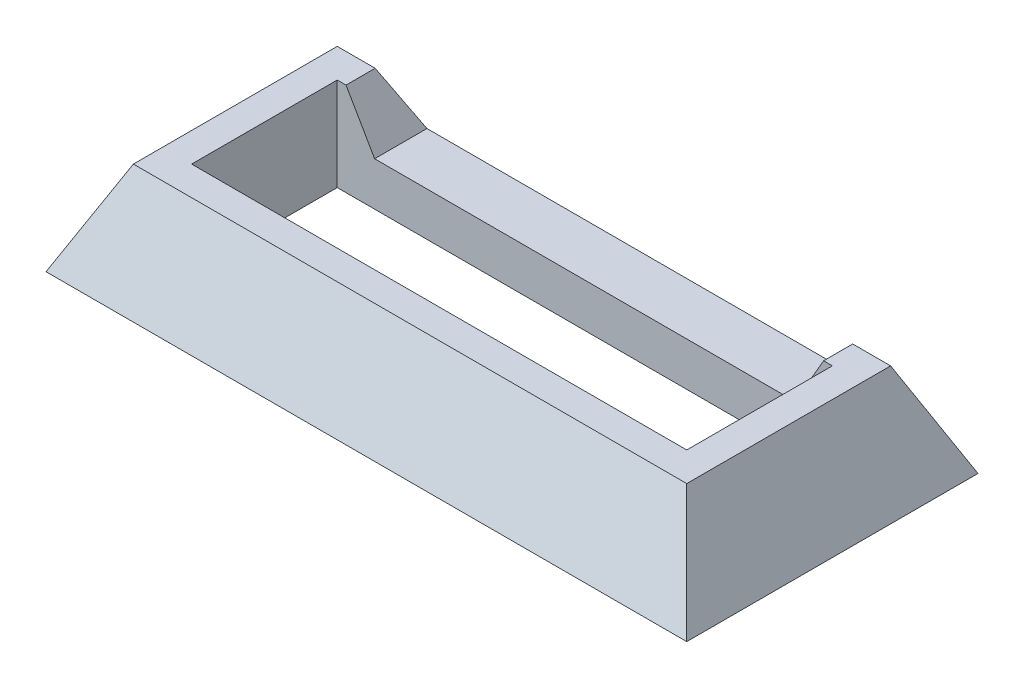
ISO-10303-21;
HEADER;
FILE_DESCRIPTION(('STEP AP214'),'2;1');
FILE_NAME('part.step','',(''),(''),'','','');
FILE_SCHEMA(('AUTOMOTIVE_DESIGN { 1 0 10303 214 1 1 1 1 }'));
ENDSEC;
DATA;
#1=APPLICATION_CONTEXT('core data for automotive mechanical design processes');
#2=APPLICATION_PROTOCOL_DEFINITION('international standard','automotive_design',2000,#1);
#3=PRODUCT_CONTEXT('',#1,'mechanical');
#4=PRODUCT('Part','Part','',(#3));
#5=PRODUCT_RELATED_PRODUCT_CATEGORY('part','',(#4));
#6=PRODUCT_DEFINITION_FORMATION('','',#4);
#7=PRODUCT_DEFINITION_CONTEXT('part definition',#1,'design');
#8=PRODUCT_DEFINITION('design','',#6,#7);
#9=PRODUCT_DEFINITION_SHAPE('','',#8);
#10=(LENGTH_UNIT() NAMED_UNIT(*) SI_UNIT(.MILLI.,.METRE.));
#11=(NAMED_UNIT(*) PLANE_ANGLE_UNIT() SI_UNIT($,.RADIAN.));
#12=(NAMED_UNIT(*) SI_UNIT($,.STERADIAN.) SOLID_ANGLE_UNIT());
#13=UNCERTAINTY_MEASURE_WITH_UNIT(LENGTH_MEASURE(1.E-05),#10,'distance_accuracy_value','');
#14=(GEOMETRIC_REPRESENTATION_CONTEXT(3) GLOBAL_UNCERTAINTY_ASSIGNED_CONTEXT((#13)) GLOBAL_UNIT_ASSIGNED_CONTEXT((#10,
#11,#12)) REPRESENTATION_CONTEXT('',''));
#15=CARTESIAN_POINT('',(0.,0.,0.));
#16=DIRECTION('',(0.,0.,1.));
#17=DIRECTION('',(1.,0.,0.));
#18=AXIS2_PLACEMENT_3D('',#15,#16,#17);
#19=CARTESIAN_POINT('',(0.,0.,0.));
#20=DIRECTION('',(0.,-1.,0.));
#21=DIRECTION('',(0.,0.,-1.));
#22=AXIS2_PLACEMENT_3D('',#19,#20,#21);
#23=PLANE('',#22);
#24=DIRECTION('',(0.,0.,1.));
#25=VECTOR('',#24,1.);
#26=CARTESIAN_POINT('',(8.5,0.,0.));
#27=LINE('',#26,#25);
#28=CARTESIAN_POINT('',(8.5,0.,-2.5));
#29=VERTEX_POINT('',#28);
#30=CARTESIAN_POINT('',(8.5,0.,2.5));
#31=VERTEX_POINT('',#30);
#32=EDGE_CURVE('E69',#29,#31,#27,.T.);
#33=ORIENTED_EDGE('',*,*,#32,.F.);
#34=DIRECTION('',(1.,0.,0.));
#35=VECTOR('',#34,1.);
#36=CARTESIAN_POINT('',(0.,0.,-2.5));
#37=LINE('',#36,#35);
#38=CARTESIAN_POINT('',(-8.5,0.,-2.5));
#39=VERTEX_POINT('',#38);
#40=EDGE_CURVE('E171',#39,#29,#37,.T.);
#41=ORIENTED_EDGE('',*,*,#40,.F.);
#42=DIRECTION('',(0.,0.,1.));
#43=VECTOR('',#42,1.);
#44=CARTESIAN_POINT('',(-8.5,0.,0.));
#45=LINE('',#44,#43);
#46=CARTESIAN_POINT('',(-8.5,0.,2.5));
#47=VERTEX_POINT('',#46);
#48=EDGE_CURVE('E173',#39,#47,#45,.T.);
#49=ORIENTED_EDGE('',*,*,#48,.T.);
#50=DIRECTION('',(1.,0.,0.));
#51=VECTOR('',#50,1.);
#52=CARTESIAN_POINT('',(0.,0.,2.5));
#53=LINE('',#52,#51);
#54=EDGE_CURVE('E176',#47,#31,#53,.T.);
#55=ORIENTED_EDGE('',*,*,#54,.T.);
#56=EDGE_LOOP('',(#33,#41,#49,#55));
#57=FACE_BOUND('',#56,.T.);
#58=DIRECTION('',(1.,0.,0.));
#59=VECTOR('',#58,1.);
#60=CARTESIAN_POINT('',(-11.,0.,-5.));
#61=LINE('',#60,#59);
#62=CARTESIAN_POINT('',(-11.,0.,-5.));
#63=VERTEX_POINT('',#62);
#64=CARTESIAN_POINT('',(11.,0.,-5.));
#65=VERTEX_POINT('',#64);
#66=EDGE_CURVE('E234',#63,#65,#61,.T.);
#67=ORIENTED_EDGE('',*,*,#66,.T.);
#68=DIRECTION('',(0.,0.,1.));
#69=VECTOR('',#68,1.);
#70=CARTESIAN_POINT('',(11.,0.,-5.));
#71=LINE('',#70,#69);
#72=CARTESIAN_POINT('',(11.,0.,5.));
#73=VERTEX_POINT('',#72);
#74=EDGE_CURVE('E248',#65,#73,#71,.T.);
#75=ORIENTED_EDGE('',*,*,#74,.T.);
#76=DIRECTION('',(1.,0.,0.));
#77=VECTOR('',#76,1.);
#78=CARTESIAN_POINT('',(-11.,0.,5.));
#79=LINE('',#78,#77);
#80=CARTESIAN_POINT('',(-11.,0.,5.));
#81=VERTEX_POINT('',#80);
#82=EDGE_CURVE('E53',#81,#73,#79,.T.);
#83=ORIENTED_EDGE('',*,*,#82,.F.);
#84=DIRECTION('',(0.,0.,1.));
#85=VECTOR('',#84,1.);
#86=CARTESIAN_POINT('',(-11.,0.,-5.));
#87=LINE('',#86,#85);
#88=EDGE_CURVE('E12',#63,#81,#87,.T.);
#89=ORIENTED_EDGE('',*,*,#88,.F.);
#90=EDGE_LOOP('',(#67,#75,#83,#89));
#91=FACE_BOUND('',#90,.T.);
#92=ADVANCED_FACE('F43',(#57,#91),#23,.T.);
#93=CARTESIAN_POINT('',(0.,3.2,0.));
#94=DIRECTION('',(0.,-1.,0.));
#95=DIRECTION('',(0.,0.,-1.));
#96=AXIS2_PLACEMENT_3D('',#93,#94,#95);
#97=PLANE('',#96);
#98=DIRECTION('',(-1.,0.,0.));
#99=VECTOR('',#98,1.);
#100=CARTESIAN_POINT('',(0.,3.2,-2.5));
#101=LINE('',#100,#99);
#102=CARTESIAN_POINT('',(-8.19837382249269,3.2,-2.5));
#103=VERTEX_POINT('',#102);
#104=CARTESIAN_POINT('',(-8.5,3.2,-2.5));
#105=VERTEX_POINT('',#104);
#106=EDGE_CURVE('E163',#103,#105,#101,.T.);
#107=ORIENTED_EDGE('',*,*,#106,.F.);
#108=DIRECTION('',(0.,0.,1.));
#109=VECTOR('',#108,1.);
#110=CARTESIAN_POINT('',(-8.19837382249269,3.2,-5.0011));
#111=LINE('',#110,#109);
#112=CARTESIAN_POINT('',(-8.19837382249269,3.2,-3.5));
#113=VERTEX_POINT('',#112);
#114=EDGE_CURVE('E369',#113,#103,#111,.T.);
#115=ORIENTED_EDGE('',*,*,#114,.F.);
#116=DIRECTION('',(1.,0.,0.));
#117=VECTOR('',#116,1.);
#118=CARTESIAN_POINT('',(-9.5,3.2,-3.5));
#119=LINE('',#118,#117);
#120=CARTESIAN_POINT('',(-9.5,3.2,-3.5));
#121=VERTEX_POINT('',#120);
#122=EDGE_CURVE('E47',#121,#113,#119,.T.);
#123=ORIENTED_EDGE('',*,*,#122,.F.);
#124=DIRECTION('',(0.,0.,1.));
#125=VECTOR('',#124,1.);
#126=CARTESIAN_POINT('',(-9.5,3.2,-3.5));
#127=LINE('',#126,#125);
#128=CARTESIAN_POINT('',(-9.5,3.2,3.5));
#129=VERTEX_POINT('',#128);
#130=EDGE_CURVE('E194',#121,#129,#127,.T.);
#131=ORIENTED_EDGE('',*,*,#130,.T.);
#132=DIRECTION('',(1.,0.,0.));
#133=VECTOR('',#132,1.);
#134=CARTESIAN_POINT('',(-9.5,3.2,3.5));
#135=LINE('',#134,#133);
#136=CARTESIAN_POINT('',(9.5,3.2,3.5));
#137=VERTEX_POINT('',#136);
#138=EDGE_CURVE('E285',#129,#137,#135,.T.);
#139=ORIENTED_EDGE('',*,*,#138,.T.);
#140=DIRECTION('',(0.,0.,1.));
#141=VECTOR('',#140,1.);
#142=CARTESIAN_POINT('',(9.5,3.2,-3.5));
#143=LINE('',#142,#141);
#144=CARTESIAN_POINT('',(9.5,3.2,-3.5));
#145=VERTEX_POINT('',#144);
#146=EDGE_CURVE('E301',#145,#137,#143,.T.);
#147=ORIENTED_EDGE('',*,*,#146,.F.);
#148=CARTESIAN_POINT('',(8.19837382249268,3.2,-3.5));
#149=VERTEX_POINT('',#148);
#150=EDGE_CURVE('E154',#149,#145,#119,.T.);
#151=ORIENTED_EDGE('',*,*,#150,.F.);
#152=DIRECTION('',(0.,0.,-1.));
#153=VECTOR('',#152,1.);
#154=CARTESIAN_POINT('',(8.19837382249268,3.2,-5.0011));
#155=LINE('',#154,#153);
#156=CARTESIAN_POINT('',(8.19837382249268,3.2,-2.5));
#157=VERTEX_POINT('',#156);
#158=EDGE_CURVE('E139',#157,#149,#155,.T.);
#159=ORIENTED_EDGE('',*,*,#158,.F.);
#160=CARTESIAN_POINT('',(8.5,3.2,-2.5));
#161=VERTEX_POINT('',#160);
#162=EDGE_CURVE('E152',#161,#157,#101,.T.);
#163=ORIENTED_EDGE('',*,*,#162,.F.);
#164=DIRECTION('',(0.,0.,-1.));
#165=VECTOR('',#164,1.);
#166=CARTESIAN_POINT('',(8.5,3.2,0.));
#167=LINE('',#166,#165);
#168=CARTESIAN_POINT('',(8.5,3.2,2.5));
#169=VERTEX_POINT('',#168);
#170=EDGE_CURVE('E162',#169,#161,#167,.T.);
#171=ORIENTED_EDGE('',*,*,#170,.F.);
#172=DIRECTION('',(-1.,0.,0.));
#173=VECTOR('',#172,1.);
#174=CARTESIAN_POINT('',(0.,3.2,2.5));
#175=LINE('',#174,#173);
#176=CARTESIAN_POINT('',(-8.5,3.2,2.5));
#177=VERTEX_POINT('',#176);
#178=EDGE_CURVE('E186',#169,#177,#175,.T.);
#179=ORIENTED_EDGE('',*,*,#178,.T.);
#180=DIRECTION('',(0.,0.,-1.));
#181=VECTOR('',#180,1.);
#182=CARTESIAN_POINT('',(-8.5,3.2,0.));
#183=LINE('',#182,#181);
#184=EDGE_CURVE('E166',#177,#105,#183,.T.);
#185=ORIENTED_EDGE('',*,*,#184,.T.);
#186=EDGE_LOOP('',(#107,#115,#123,#131,#139,#147,#151,#159,#163,#171,#179,#185));
#187=FACE_BOUND('',#186,.T.);
#188=ADVANCED_FACE('F150',(#187),#97,.F.);
#189=CARTESIAN_POINT('',(0.,1.92153722978383,-4.09927942353883));
#190=DIRECTION('',(0.,-0.42443387623072,0.905458935958868));
#191=DIRECTION('',(0.,-0.905458935958869,-0.42443387623072));
#192=AXIS2_PLACEMENT_3D('',#189,#190,#191);
#193=PLANE('',#192);
#194=ORIENTED_EDGE('',*,*,#122,.T.);
#195=DIRECTION('',(-0.463281832788541,0.802427672613382,0.376137971537523));
#196=VECTOR('',#195,1.);
#197=CARTESIAN_POINT('',(-13.2899976505815,12.0189511632781,0.633883357786629));
#198=LINE('',#197,#196);
#199=CARTESIAN_POINT('',(-7.21687836487032,1.5,-4.296875));
#200=VERTEX_POINT('',#199);
#201=EDGE_CURVE('E372',#200,#113,#198,.T.);
#202=ORIENTED_EDGE('',*,*,#201,.F.);
#203=DIRECTION('',(-1.,0.,0.));
#204=VECTOR('',#203,1.);
#205=CARTESIAN_POINT('',(-7.21687836487032,1.5,-4.296875));
#206=LINE('',#205,#204);
#207=CARTESIAN_POINT('',(7.21687836487032,1.5,-4.296875));
#208=VERTEX_POINT('',#207);
#209=EDGE_CURVE('E438',#208,#200,#206,.T.);
#210=ORIENTED_EDGE('',*,*,#209,.F.);
#211=DIRECTION('',(-0.463281832788541,-0.802427672613382,-0.376137971537523));
#212=VECTOR('',#211,1.);
#213=CARTESIAN_POINT('',(7.0941616031053,1.28744833368267,-4.39650859358625));
#214=LINE('',#213,#212);
#215=EDGE_CURVE('E156',#149,#208,#214,.T.);
#216=ORIENTED_EDGE('',*,*,#215,.F.);
#217=ORIENTED_EDGE('',*,*,#150,.T.);
#218=DIRECTION('',(0.390699195802968,-0.833491617712997,-0.390699195802967));
#219=VECTOR('',#218,1.);
#220=CARTESIAN_POINT('',(9.5,3.2,-3.5));
#221=LINE('',#220,#219);
#222=EDGE_CURVE('E304',#145,#65,#221,.T.);
#223=ORIENTED_EDGE('',*,*,#222,.T.);
#224=ORIENTED_EDGE('',*,*,#66,.F.);
#225=DIRECTION('',(-0.390699195802967,-0.833491617712997,-0.390699195802968));
#226=VECTOR('',#225,1.);
#227=CARTESIAN_POINT('',(-9.5,3.2,-3.5));
#228=LINE('',#227,#226);
#229=EDGE_CURVE('E200',#121,#63,#228,.T.);
#230=ORIENTED_EDGE('',*,*,#229,.F.);
#231=EDGE_LOOP('',(#194,#202,#210,#216,#217,#223,#224,#230));
#232=FACE_BOUND('',#231,.T.);
#233=ADVANCED_FACE('F213',(#232),#193,.F.);
#234=CARTESIAN_POINT('',(-9.01841473178543,4.22738190552442,0.));
#235=DIRECTION('',(-0.905458935958869,0.424433876230719,0.));
#236=DIRECTION('',(-0.424433876230719,-0.905458935958869,0.));
#237=AXIS2_PLACEMENT_3D('',#234,#235,#236);
#238=PLANE('',#237);
#239=ORIENTED_EDGE('',*,*,#229,.T.);
#240=ORIENTED_EDGE('',*,*,#88,.T.);
#241=DIRECTION('',(-0.390699195802967,-0.833491617712997,0.390699195802967));
#242=VECTOR('',#241,1.);
#243=CARTESIAN_POINT('',(-9.5,3.2,3.5));
#244=LINE('',#243,#242);
#245=EDGE_CURVE('E290',#129,#81,#244,.T.);
#246=ORIENTED_EDGE('',*,*,#245,.F.);
#247=ORIENTED_EDGE('',*,*,#130,.F.);
#248=EDGE_LOOP('',(#239,#240,#246,#247));
#249=FACE_BOUND('',#248,.T.);
#250=ADVANCED_FACE('F202',(#249),#238,.T.);
#251=CARTESIAN_POINT('',(9.01841473178542,4.22738190552442,0.));
#252=DIRECTION('',(-0.905458935958868,-0.42443387623072,0.));
#253=DIRECTION('',(0.42443387623072,-0.905458935958869,0.));
#254=AXIS2_PLACEMENT_3D('',#251,#252,#253);
#255=PLANE('',#254);
#256=DIRECTION('',(0.390699195802968,-0.833491617712997,0.390699195802967));
#257=VECTOR('',#256,1.);
#258=CARTESIAN_POINT('',(9.5,3.2,3.5));
#259=LINE('',#258,#257);
#260=EDGE_CURVE('E288',#137,#73,#259,.T.);
#261=ORIENTED_EDGE('',*,*,#260,.T.);
#262=ORIENTED_EDGE('',*,*,#74,.F.);
#263=ORIENTED_EDGE('',*,*,#222,.F.);
#264=ORIENTED_EDGE('',*,*,#146,.T.);
#265=EDGE_LOOP('',(#261,#262,#263,#264));
#266=FACE_BOUND('',#265,.T.);
#267=ADVANCED_FACE('F212',(#266),#255,.F.);
#268=CARTESIAN_POINT('',(0.,1.92153722978383,4.09927942353883));
#269=DIRECTION('',(0.,0.424433876230719,0.905458935958869));
#270=DIRECTION('',(0.,-0.905458935958869,0.424433876230719));
#271=AXIS2_PLACEMENT_3D('',#268,#269,#270);
#272=PLANE('',#271);
#273=ORIENTED_EDGE('',*,*,#245,.T.);
#274=ORIENTED_EDGE('',*,*,#82,.T.);
#275=ORIENTED_EDGE('',*,*,#260,.F.);
#276=ORIENTED_EDGE('',*,*,#138,.F.);
#277=EDGE_LOOP('',(#273,#274,#275,#276));
#278=FACE_BOUND('',#277,.T.);
#279=ADVANCED_FACE('F265',(#278),#272,.T.);
#280=CARTESIAN_POINT('',(8.5,3.2011,0.));
#281=DIRECTION('',(1.,0.,0.));
#282=DIRECTION('',(0.,0.,-1.));
#283=AXIS2_PLACEMENT_3D('',#280,#281,#282);
#284=PLANE('',#283);
#285=ORIENTED_EDGE('',*,*,#170,.T.);
#286=DIRECTION('',(0.,-1.,0.));
#287=VECTOR('',#286,1.);
#288=CARTESIAN_POINT('',(8.5,3.2011,-2.5));
#289=LINE('',#288,#287);
#290=EDGE_CURVE('E161',#161,#29,#289,.T.);
#291=ORIENTED_EDGE('',*,*,#290,.T.);
#292=ORIENTED_EDGE('',*,*,#32,.T.);
#293=DIRECTION('',(0.,-1.,0.));
#294=VECTOR('',#293,1.);
#295=CARTESIAN_POINT('',(8.5,3.2011,2.5));
#296=LINE('',#295,#294);
#297=EDGE_CURVE('E179',#169,#31,#296,.T.);
#298=ORIENTED_EDGE('',*,*,#297,.F.);
#299=EDGE_LOOP('',(#285,#291,#292,#298));
#300=FACE_BOUND('',#299,.T.);
#301=ADVANCED_FACE('F273',(#300),#284,.F.);
#302=CARTESIAN_POINT('',(0.,3.2011,-2.5));
#303=DIRECTION('',(0.,0.,-1.));
#304=DIRECTION('',(-1.,0.,0.));
#305=AXIS2_PLACEMENT_3D('',#302,#303,#304);
#306=PLANE('',#305);
#307=DIRECTION('',(1.,0.,0.));
#308=VECTOR('',#307,1.);
#309=CARTESIAN_POINT('',(-7.21687836487032,1.5,-2.5));
#310=LINE('',#309,#308);
#311=CARTESIAN_POINT('',(-7.21687836487032,1.5,-2.5));
#312=VERTEX_POINT('',#311);
#313=CARTESIAN_POINT('',(7.21687836487032,1.5,-2.5));
#314=VERTEX_POINT('',#313);
#315=EDGE_CURVE('E61',#312,#314,#310,.T.);
#316=ORIENTED_EDGE('',*,*,#315,.F.);
#317=DIRECTION('',(0.5,-0.866025403784439,0.));
#318=VECTOR('',#317,1.);
#319=CARTESIAN_POINT('',(-14.4337567297406,14.,-2.5));
#320=LINE('',#319,#318);
#321=EDGE_CURVE('E441',#103,#312,#320,.T.);
#322=ORIENTED_EDGE('',*,*,#321,.F.);
#323=ORIENTED_EDGE('',*,*,#106,.T.);
#324=DIRECTION('',(0.,-1.,0.));
#325=VECTOR('',#324,1.);
#326=CARTESIAN_POINT('',(-8.5,3.2011,-2.5));
#327=LINE('',#326,#325);
#328=EDGE_CURVE('E183',#105,#39,#327,.T.);
#329=ORIENTED_EDGE('',*,*,#328,.T.);
#330=ORIENTED_EDGE('',*,*,#40,.T.);
#331=ORIENTED_EDGE('',*,*,#290,.F.);
#332=ORIENTED_EDGE('',*,*,#162,.T.);
#333=DIRECTION('',(0.5,0.866025403784439,0.));
#334=VECTOR('',#333,1.);
#335=CARTESIAN_POINT('',(7.21687836487032,1.5,-2.5));
#336=LINE('',#335,#334);
#337=EDGE_CURVE('E135',#314,#157,#336,.T.);
#338=ORIENTED_EDGE('',*,*,#337,.F.);
#339=EDGE_LOOP('',(#316,#322,#323,#329,#330,#331,#332,#338));
#340=FACE_BOUND('',#339,.T.);
#341=ADVANCED_FACE('F159',(#340),#306,.F.);
#342=CARTESIAN_POINT('',(-8.5,3.2011,0.));
#343=DIRECTION('',(1.,0.,0.));
#344=DIRECTION('',(0.,0.,-1.));
#345=AXIS2_PLACEMENT_3D('',#342,#343,#344);
#346=PLANE('',#345);
#347=DIRECTION('',(0.,-1.,0.));
#348=VECTOR('',#347,1.);
#349=CARTESIAN_POINT('',(-8.5,3.2011,2.5));
#350=LINE('',#349,#348);
#351=EDGE_CURVE('E181',#177,#47,#350,.T.);
#352=ORIENTED_EDGE('',*,*,#351,.T.);
#353=ORIENTED_EDGE('',*,*,#48,.F.);
#354=ORIENTED_EDGE('',*,*,#328,.F.);
#355=ORIENTED_EDGE('',*,*,#184,.F.);
#356=EDGE_LOOP('',(#352,#353,#354,#355));
#357=FACE_BOUND('',#356,.T.);
#358=ADVANCED_FACE('F447',(#357),#346,.T.);
#359=CARTESIAN_POINT('',(0.,3.2011,2.5));
#360=DIRECTION('',(0.,0.,-1.));
#361=DIRECTION('',(-1.,0.,0.));
#362=AXIS2_PLACEMENT_3D('',#359,#360,#361);
#363=PLANE('',#362);
#364=ORIENTED_EDGE('',*,*,#297,.T.);
#365=ORIENTED_EDGE('',*,*,#54,.F.);
#366=ORIENTED_EDGE('',*,*,#351,.F.);
#367=ORIENTED_EDGE('',*,*,#178,.F.);
#368=EDGE_LOOP('',(#364,#365,#366,#367));
#369=FACE_BOUND('',#368,.T.);
#370=ADVANCED_FACE('F420',(#369),#363,.T.);
#371=CARTESIAN_POINT('',(-7.21687836487032,1.5,-5.0011));
#372=DIRECTION('',(0.,-1.,0.));
#373=DIRECTION('',(0.,0.,-1.));
#374=AXIS2_PLACEMENT_3D('',#371,#372,#373);
#375=PLANE('',#374);
#376=ORIENTED_EDGE('',*,*,#209,.T.);
#377=DIRECTION('',(0.,0.,1.));
#378=VECTOR('',#377,1.);
#379=CARTESIAN_POINT('',(-7.21687836487032,1.5,-5.0011));
#380=LINE('',#379,#378);
#381=EDGE_CURVE('E144',#200,#312,#380,.T.);
#382=ORIENTED_EDGE('',*,*,#381,.T.);
#383=ORIENTED_EDGE('',*,*,#315,.T.);
#384=DIRECTION('',(0.,0.,1.));
#385=VECTOR('',#384,1.);
#386=CARTESIAN_POINT('',(7.21687836487032,1.5,-5.0011));
#387=LINE('',#386,#385);
#388=EDGE_CURVE('E141',#208,#314,#387,.T.);
#389=ORIENTED_EDGE('',*,*,#388,.F.);
#390=EDGE_LOOP('',(#376,#382,#383,#389));
#391=FACE_BOUND('',#390,.T.);
#392=ADVANCED_FACE('F454',(#391),#375,.F.);
#393=CARTESIAN_POINT('',(-14.4337567297406,14.,-5.0011));
#394=DIRECTION('',(-0.866025403784439,-0.5,0.));
#395=DIRECTION('',(0.5,-0.866025403784439,0.));
#396=AXIS2_PLACEMENT_3D('',#393,#394,#395);
#397=PLANE('',#396);
#398=ORIENTED_EDGE('',*,*,#201,.T.);
#399=ORIENTED_EDGE('',*,*,#114,.T.);
#400=ORIENTED_EDGE('',*,*,#321,.T.);
#401=ORIENTED_EDGE('',*,*,#381,.F.);
#402=EDGE_LOOP('',(#398,#399,#400,#401));
#403=FACE_BOUND('',#402,.T.);
#404=ADVANCED_FACE('F446',(#403),#397,.F.);
#405=CARTESIAN_POINT('',(7.21687836487032,1.5,-5.0011));
#406=DIRECTION('',(0.866025403784438,-0.5,0.));
#407=DIRECTION('',(0.5,0.866025403784439,0.));
#408=AXIS2_PLACEMENT_3D('',#405,#406,#407);
#409=PLANE('',#408);
#410=ORIENTED_EDGE('',*,*,#215,.T.);
#411=ORIENTED_EDGE('',*,*,#388,.T.);
#412=ORIENTED_EDGE('',*,*,#337,.T.);
#413=ORIENTED_EDGE('',*,*,#158,.T.);
#414=EDGE_LOOP('',(#410,#411,#412,#413));
#415=FACE_BOUND('',#414,.T.);
#416=ADVANCED_FACE('F138',(#415),#409,.F.);
#417=CLOSED_SHELL('',(#92,#188,#233,#250,#267,#279,#301,#341,#358,#370,#392,#404,#416));
#418=MANIFOLD_SOLID_BREP('B2',#417);
#419=ADVANCED_BREP_SHAPE_REPRESENTATION('',(#18,#418),#14);
#420=SHAPE_DEFINITION_REPRESENTATION(#9,#419);
ENDSEC;
END-ISO-10303-21;
